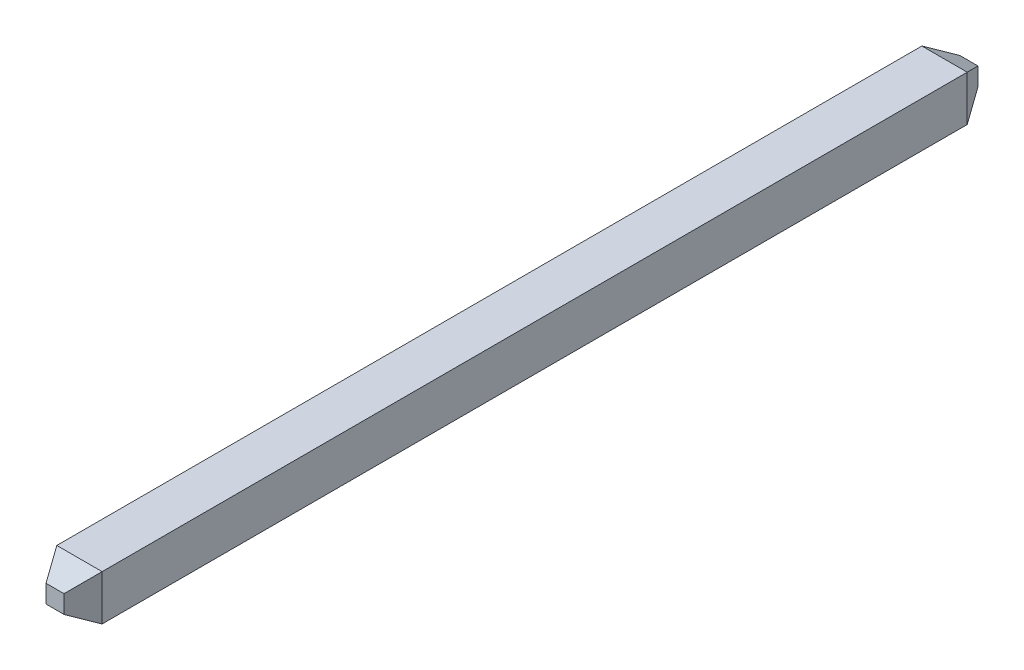
ISO-10303-21;
HEADER;
FILE_DESCRIPTION(('STEP AP214'),'2;1');
FILE_NAME('part.step','',(''),(''),'','','');
FILE_SCHEMA(('AUTOMOTIVE_DESIGN { 1 0 10303 214 1 1 1 1 }'));
ENDSEC;
DATA;
#1=APPLICATION_CONTEXT('core data for automotive mechanical design processes');
#2=APPLICATION_PROTOCOL_DEFINITION('international standard','automotive_design',2000,#1);
#3=PRODUCT_CONTEXT('',#1,'mechanical');
#4=PRODUCT('Part','Part','',(#3));
#5=PRODUCT_RELATED_PRODUCT_CATEGORY('part','',(#4));
#6=PRODUCT_DEFINITION_FORMATION('','',#4);
#7=PRODUCT_DEFINITION_CONTEXT('part definition',#1,'design');
#8=PRODUCT_DEFINITION('design','',#6,#7);
#9=PRODUCT_DEFINITION_SHAPE('','',#8);
#10=(LENGTH_UNIT() NAMED_UNIT(*) SI_UNIT(.MILLI.,.METRE.));
#11=(NAMED_UNIT(*) PLANE_ANGLE_UNIT() SI_UNIT($,.RADIAN.));
#12=(NAMED_UNIT(*) SI_UNIT($,.STERADIAN.) SOLID_ANGLE_UNIT());
#13=UNCERTAINTY_MEASURE_WITH_UNIT(LENGTH_MEASURE(1.E-05),#10,'distance_accuracy_value','');
#14=(GEOMETRIC_REPRESENTATION_CONTEXT(3) GLOBAL_UNCERTAINTY_ASSIGNED_CONTEXT((#13)) GLOBAL_UNIT_ASSIGNED_CONTEXT((#10,
#11,#12)) REPRESENTATION_CONTEXT('',''));
#15=CARTESIAN_POINT('',(0.,0.,0.));
#16=DIRECTION('',(0.,0.,1.));
#17=DIRECTION('',(1.,0.,0.));
#18=AXIS2_PLACEMENT_3D('',#15,#16,#17);
#19=CARTESIAN_POINT('',(2.66011510041924,-1.595,-3.20872569516347));
#20=DIRECTION('',(0.872569516347454,0.,-0.488489958076081));
#21=DIRECTION('',(-0.488489958076081,0.,-0.872569516347454));
#22=AXIS2_PLACEMENT_3D('',#19,#20,#21);
#23=PLANE('',#22);
#24=DIRECTION('',(0.,1.,0.));
#25=VECTOR('',#24,1.);
#26=CARTESIAN_POINT('',(2.85534185664468,-1.595,-2.86000017186176));
#27=LINE('',#26,#25);
#28=CARTESIAN_POINT('',(2.85534185663262,-1.58500002468493,-2.85999984563027));
#29=VERTEX_POINT('',#28);
#30=CARTESIAN_POINT('',(2.85534201729186,-0.954999839641339,-2.8599998849043));
#31=VERTEX_POINT('',#30);
#32=EDGE_CURVE('E145',#29,#31,#27,.T.);
#33=ORIENTED_EDGE('',*,*,#32,.F.);
#34=DIRECTION('',(0.439072617568647,-0.438284036988111,0.784297353956279));
#35=VECTOR('',#34,1.);
#36=CARTESIAN_POINT('',(2.665,-1.395,-3.2));
#37=LINE('',#36,#35);
#38=CARTESIAN_POINT('',(2.665,-1.395,-3.2));
#39=VERTEX_POINT('',#38);
#40=EDGE_CURVE('E142',#39,#29,#37,.T.);
#41=ORIENTED_EDGE('',*,*,#40,.F.);
#42=DIRECTION('',(0.,1.,0.));
#43=VECTOR('',#42,1.);
#44=CARTESIAN_POINT('',(2.665,-1.405,-3.2));
#45=LINE('',#44,#43);
#46=CARTESIAN_POINT('',(2.665,-1.145,-3.2));
#47=VERTEX_POINT('',#46);
#48=EDGE_CURVE('E94',#47,#39,#45,.F.);
#49=ORIENTED_EDGE('',*,*,#48,.F.);
#50=DIRECTION('',(-0.439072617568647,-0.438284036988111,-0.784297353956279));
#51=VECTOR('',#50,1.);
#52=CARTESIAN_POINT('',(2.85534185664468,-0.955000000000001,-2.86000017186176));
#53=LINE('',#52,#51);
#54=EDGE_CURVE('E134',#31,#47,#53,.T.);
#55=ORIENTED_EDGE('',*,*,#54,.F.);
#56=EDGE_LOOP('',(#33,#41,#49,#55));
#57=FACE_BOUND('',#56,.T.);
#58=ADVANCED_FACE('F16',(#57),#23,.T.);
#59=CARTESIAN_POINT('',(2.66036702814295,-1.595,9.50441734607014));
#60=DIRECTION('',(0.873317045523297,0.,0.487152273933376));
#61=DIRECTION('',(0.487152273933376,0.,-0.873317045523297));
#62=AXIS2_PLACEMENT_3D('',#59,#60,#61);
#63=PLANE('',#62);
#64=DIRECTION('',(-0.437799852400903,0.438586917260844,0.784839349959835));
#65=VECTOR('',#64,1.);
#66=CARTESIAN_POINT('',(2.85489789955164,-1.58500031317147,9.15568378706485));
#67=LINE('',#66,#65);
#68=CARTESIAN_POINT('',(2.85489765454992,-1.58500010892315,9.15568368845103));
#69=VERTEX_POINT('',#68);
#70=CARTESIAN_POINT('',(2.66523855088228,-1.395,9.49568417561491));
#71=VERTEX_POINT('',#70);
#72=EDGE_CURVE('E151',#69,#71,#67,.T.);
#73=ORIENTED_EDGE('',*,*,#72,.F.);
#74=DIRECTION('',(0.,1.,0.));
#75=VECTOR('',#74,1.);
#76=CARTESIAN_POINT('',(2.85489853900642,-1.595,9.155683722437));
#77=LINE('',#76,#75);
#78=CARTESIAN_POINT('',(2.8548976528046,-0.954999822967402,9.15568371270386));
#79=VERTEX_POINT('',#78);
#80=EDGE_CURVE('E105',#79,#69,#77,.F.);
#81=ORIENTED_EDGE('',*,*,#80,.F.);
#82=DIRECTION('',(0.437799852400902,0.438586917260844,-0.784839349959836));
#83=VECTOR('',#82,1.);
#84=CARTESIAN_POINT('',(2.66523855088228,-1.145,9.49568417561491));
#85=LINE('',#84,#83);
#86=CARTESIAN_POINT('',(2.66523855088228,-1.145,9.49568417561491));
#87=VERTEX_POINT('',#86);
#88=EDGE_CURVE('E100',#87,#79,#85,.T.);
#89=ORIENTED_EDGE('',*,*,#88,.F.);
#90=DIRECTION('',(0.,1.,0.));
#91=VECTOR('',#90,1.);
#92=CARTESIAN_POINT('',(2.66523855088228,-1.135,9.49568417561491));
#93=LINE('',#92,#91);
#94=EDGE_CURVE('E19',#71,#87,#93,.T.);
#95=ORIENTED_EDGE('',*,*,#94,.F.);
#96=EDGE_LOOP('',(#73,#81,#89,#95));
#97=FACE_BOUND('',#96,.T.);
#98=ADVANCED_FACE('F102',(#97),#63,.T.);
#99=CARTESIAN_POINT('',(2.40523855088228,-1.135,9.49568417561491));
#100=DIRECTION('',(0.,0.,1.));
#101=DIRECTION('',(1.,0.,0.));
#102=AXIS2_PLACEMENT_3D('',#99,#100,#101);
#103=PLANE('',#102);
#104=DIRECTION('',(1.,0.,0.));
#105=VECTOR('',#104,1.);
#106=CARTESIAN_POINT('',(2.2148966942376,-1.145,9.49568417561491));
#107=LINE('',#106,#105);
#108=CARTESIAN_POINT('',(2.41523855088228,-1.145,9.49568417561491));
#109=VERTEX_POINT('',#108);
#110=EDGE_CURVE('E110',#109,#87,#107,.T.);
#111=ORIENTED_EDGE('',*,*,#110,.F.);
#112=DIRECTION('',(0.,1.,0.));
#113=VECTOR('',#112,1.);
#114=CARTESIAN_POINT('',(2.41523855088228,-1.595,9.49568417561491));
#115=LINE('',#114,#113);
#116=CARTESIAN_POINT('',(2.41523855088228,-1.395,9.49568417561491));
#117=VERTEX_POINT('',#116);
#118=EDGE_CURVE('E160',#117,#109,#115,.T.);
#119=ORIENTED_EDGE('',*,*,#118,.F.);
#120=DIRECTION('',(1.,0.,0.));
#121=VECTOR('',#120,1.);
#122=CARTESIAN_POINT('',(2.2148966942376,-1.395,9.49568417561491));
#123=LINE('',#122,#121);
#124=EDGE_CURVE('E115',#71,#117,#123,.F.);
#125=ORIENTED_EDGE('',*,*,#124,.F.);
#126=ORIENTED_EDGE('',*,*,#94,.T.);
#127=EDGE_LOOP('',(#111,#119,#125,#126));
#128=FACE_BOUND('',#127,.T.);
#129=ADVANCED_FACE('F112',(#128),#103,.T.);
#130=CARTESIAN_POINT('',(2.2148966942376,-1.14987821545568,9.50441360938624));
#131=DIRECTION('',(0.,0.872943377132664,0.487821545567864));
#132=DIRECTION('',(0.,-0.487821545567864,0.872943377132664));
#133=AXIS2_PLACEMENT_3D('',#130,#131,#132);
#134=PLANE('',#133);
#135=DIRECTION('',(-0.439072459537933,0.438284700441648,-0.784297071672517));
#136=VECTOR('',#135,1.);
#137=CARTESIAN_POINT('',(2.41523855088228,-1.145,9.49568417561491));
#138=LINE('',#137,#136);
#139=CARTESIAN_POINT('',(2.2248975037028,-0.954999917527427,9.15568447138296));
#140=VERTEX_POINT('',#139);
#141=EDGE_CURVE('E120',#109,#140,#138,.T.);
#142=ORIENTED_EDGE('',*,*,#141,.F.);
#143=ORIENTED_EDGE('',*,*,#110,.T.);
#144=ORIENTED_EDGE('',*,*,#88,.T.);
#145=DIRECTION('',(1.,0.,0.));
#146=VECTOR('',#145,1.);
#147=CARTESIAN_POINT('',(2.54006658937282,-0.955,9.15568497320463));
#148=LINE('',#147,#146);
#149=EDGE_CURVE('E162',#140,#79,#148,.T.);
#150=ORIENTED_EDGE('',*,*,#149,.F.);
#151=EDGE_LOOP('',(#142,#143,#144,#150));
#152=FACE_BOUND('',#151,.T.);
#153=ADVANCED_FACE('F118',(#152),#134,.T.);
#154=CARTESIAN_POINT('',(2.405,-1.405,-3.2));
#155=DIRECTION('',(0.,0.,-1.));
#156=DIRECTION('',(-1.,0.,0.));
#157=AXIS2_PLACEMENT_3D('',#154,#155,#156);
#158=PLANE('',#157);
#159=ORIENTED_EDGE('',*,*,#48,.T.);
#160=DIRECTION('',(1.,0.,0.));
#161=VECTOR('',#160,1.);
#162=CARTESIAN_POINT('',(2.21534185664468,-1.395,-3.2));
#163=LINE('',#162,#161);
#164=CARTESIAN_POINT('',(2.415,-1.395,-3.2));
#165=VERTEX_POINT('',#164);
#166=EDGE_CURVE('E138',#165,#39,#163,.T.);
#167=ORIENTED_EDGE('',*,*,#166,.F.);
#168=DIRECTION('',(0.,1.,0.));
#169=VECTOR('',#168,1.);
#170=CARTESIAN_POINT('',(2.415,-1.595,-3.2));
#171=LINE('',#170,#169);
#172=CARTESIAN_POINT('',(2.415,-1.145,-3.2));
#173=VERTEX_POINT('',#172);
#174=EDGE_CURVE('E174',#173,#165,#171,.F.);
#175=ORIENTED_EDGE('',*,*,#174,.F.);
#176=DIRECTION('',(1.,0.,0.));
#177=VECTOR('',#176,1.);
#178=CARTESIAN_POINT('',(2.21534185664468,-1.145,-3.2));
#179=LINE('',#178,#177);
#180=EDGE_CURVE('E128',#47,#173,#179,.F.);
#181=ORIENTED_EDGE('',*,*,#180,.F.);
#182=EDGE_LOOP('',(#159,#167,#175,#181));
#183=FACE_BOUND('',#182,.T.);
#184=ADVANCED_FACE('F226',(#183),#158,.T.);
#185=CARTESIAN_POINT('',(2.21534185664468,-0.950121784544321,-2.85127073809043));
#186=DIRECTION('',(0.,0.872943377132663,-0.487821545567865));
#187=DIRECTION('',(0.,0.487821545567865,0.872943377132663));
#188=AXIS2_PLACEMENT_3D('',#185,#186,#187);
#189=PLANE('',#188);
#190=DIRECTION('',(1.,0.,0.));
#191=VECTOR('',#190,1.);
#192=CARTESIAN_POINT('',(2.54006658937282,-0.955,-2.86000017186176));
#193=LINE('',#192,#191);
#194=CARTESIAN_POINT('',(2.22534144768619,-0.954999293190895,-2.8599984305592));
#195=VERTEX_POINT('',#194);
#196=EDGE_CURVE('E170',#31,#195,#193,.F.);
#197=ORIENTED_EDGE('',*,*,#196,.F.);
#198=ORIENTED_EDGE('',*,*,#54,.T.);
#199=ORIENTED_EDGE('',*,*,#180,.T.);
#200=DIRECTION('',(0.437798396819591,-0.438586429089664,-0.784840434713052));
#201=VECTOR('',#200,1.);
#202=CARTESIAN_POINT('',(2.22534066407532,-0.954999279369218,-2.85999803394471));
#203=LINE('',#202,#201);
#204=EDGE_CURVE('E181',#195,#173,#203,.T.);
#205=ORIENTED_EDGE('',*,*,#204,.F.);
#206=EDGE_LOOP('',(#197,#198,#199,#205));
#207=FACE_BOUND('',#206,.T.);
#208=ADVANCED_FACE('F224',(#207),#189,.T.);
#209=CARTESIAN_POINT('',(2.21534185664468,-1.39012178454432,-3.20872943377133));
#210=DIRECTION('',(0.,-0.872943377132663,-0.487821545567865));
#211=DIRECTION('',(0.,0.487821545567865,-0.872943377132663));
#212=AXIS2_PLACEMENT_3D('',#209,#210,#211);
#213=PLANE('',#212);
#214=ORIENTED_EDGE('',*,*,#166,.T.);
#215=ORIENTED_EDGE('',*,*,#40,.T.);
#216=DIRECTION('',(1.,0.,0.));
#217=VECTOR('',#216,1.);
#218=CARTESIAN_POINT('',(2.21494834685547,-1.585,-2.85999756200982));
#219=LINE('',#218,#217);
#220=CARTESIAN_POINT('',(2.22534198218488,-1.58500027023654,-2.85999898491791));
#221=VERTEX_POINT('',#220);
#222=EDGE_CURVE('E39',#221,#29,#219,.T.);
#223=ORIENTED_EDGE('',*,*,#222,.F.);
#224=DIRECTION('',(-0.437798396819592,-0.438586429089661,0.784840434713054));
#225=VECTOR('',#224,1.);
#226=CARTESIAN_POINT('',(2.415,-1.395,-3.2));
#227=LINE('',#226,#225);
#228=EDGE_CURVE('E178',#165,#221,#227,.T.);
#229=ORIENTED_EDGE('',*,*,#228,.F.);
#230=EDGE_LOOP('',(#214,#215,#223,#229));
#231=FACE_BOUND('',#230,.T.);
#232=ADVANCED_FACE('F227',(#231),#213,.T.);
#233=CARTESIAN_POINT('',(2.85534630826875,-1.595,-2.98065701705514));
#234=DIRECTION('',(0.999999999319383,0.,3.68949151671631E-05));
#235=DIRECTION('',(3.68949151671631E-05,0.,-0.999999999319383));
#236=AXIS2_PLACEMENT_3D('',#233,#234,#235);
#237=PLANE('',#236);
#238=DIRECTION('',(3.69481335097372E-05,0.,-0.999999999317418));
#239=VECTOR('',#238,1.);
#240=CARTESIAN_POINT('',(2.85489789955164,-0.955,9.1556837224134));
#241=LINE('',#240,#239);
#242=EDGE_CURVE('E166',#79,#31,#241,.T.);
#243=ORIENTED_EDGE('',*,*,#242,.F.);
#244=ORIENTED_EDGE('',*,*,#80,.T.);
#245=DIRECTION('',(-3.69481335097372E-05,0.,0.999999999317418));
#246=VECTOR('',#245,1.);
#247=CARTESIAN_POINT('',(2.85534185664468,-1.585,-2.86000017186176));
#248=LINE('',#247,#246);
#249=EDGE_CURVE('E187',#29,#69,#248,.T.);
#250=ORIENTED_EDGE('',*,*,#249,.F.);
#251=ORIENTED_EDGE('',*,*,#32,.T.);
#252=EDGE_LOOP('',(#243,#244,#250,#251));
#253=FACE_BOUND('',#252,.T.);
#254=ADVANCED_FACE('F229',(#253),#237,.T.);
#255=CARTESIAN_POINT('',(2.2148966942376,-1.58987821545568,9.14695491370534));
#256=DIRECTION('',(0.,-0.872943377132664,0.487821545567864));
#257=DIRECTION('',(0.,-0.487821545567864,-0.872943377132664));
#258=AXIS2_PLACEMENT_3D('',#255,#256,#257);
#259=PLANE('',#258);
#260=ORIENTED_EDGE('',*,*,#124,.T.);
#261=DIRECTION('',(0.439072459537933,0.438284700441648,0.784297071672517));
#262=VECTOR('',#261,1.);
#263=CARTESIAN_POINT('',(2.22489724886554,-1.5849998023649,9.15568533818575));
#264=LINE('',#263,#262);
#265=CARTESIAN_POINT('',(2.22489781760237,-1.58499988392429,9.15568487573228));
#266=VERTEX_POINT('',#265);
#267=EDGE_CURVE('E156',#266,#117,#264,.T.);
#268=ORIENTED_EDGE('',*,*,#267,.F.);
#269=DIRECTION('',(1.,0.,0.));
#270=VECTOR('',#269,1.);
#271=CARTESIAN_POINT('',(2.21494834685547,-1.585,9.1556837224134));
#272=LINE('',#271,#270);
#273=EDGE_CURVE('E191',#69,#266,#272,.F.);
#274=ORIENTED_EDGE('',*,*,#273,.F.);
#275=ORIENTED_EDGE('',*,*,#72,.T.);
#276=EDGE_LOOP('',(#260,#268,#274,#275));
#277=FACE_BOUND('',#276,.T.);
#278=ADVANCED_FACE('F216',(#277),#259,.T.);
#279=CARTESIAN_POINT('',(2.42012345046304,-1.595,9.50440987077839));
#280=DIRECTION('',(-0.872569516347453,0.,0.488489958076081));
#281=DIRECTION('',(0.488489958076081,0.,0.872569516347453));
#282=AXIS2_PLACEMENT_3D('',#279,#280,#281);
#283=PLANE('',#282);
#284=ORIENTED_EDGE('',*,*,#267,.T.);
#285=ORIENTED_EDGE('',*,*,#118,.T.);
#286=ORIENTED_EDGE('',*,*,#141,.T.);
#287=DIRECTION('',(0.,1.,0.));
#288=VECTOR('',#287,1.);
#289=CARTESIAN_POINT('',(2.22489853896028,-1.595,9.15568497322818));
#290=LINE('',#289,#288);
#291=EDGE_CURVE('E194',#266,#140,#290,.T.);
#292=ORIENTED_EDGE('',*,*,#291,.F.);
#293=EDGE_LOOP('',(#284,#285,#286,#292));
#294=FACE_BOUND('',#293,.T.);
#295=ADVANCED_FACE('F219',(#294),#283,.T.);
#296=CARTESIAN_POINT('',(2.54006658937282,-0.955,9.32634470275115));
#297=DIRECTION('',(0.,1.,0.));
#298=DIRECTION('',(0.,0.,1.));
#299=AXIS2_PLACEMENT_3D('',#296,#297,#298);
#300=PLANE('',#299);
#301=ORIENTED_EDGE('',*,*,#196,.T.);
#302=DIRECTION('',(-3.68949151674615E-05,0.,0.999999999319383));
#303=VECTOR('',#302,1.);
#304=CARTESIAN_POINT('',(2.22489224235438,-0.955000197635096,9.32634821671993));
#305=LINE('',#304,#303);
#306=EDGE_CURVE('E198',#140,#195,#305,.F.);
#307=ORIENTED_EDGE('',*,*,#306,.F.);
#308=ORIENTED_EDGE('',*,*,#149,.T.);
#309=ORIENTED_EDGE('',*,*,#242,.T.);
#310=EDGE_LOOP('',(#301,#307,#308,#309));
#311=FACE_BOUND('',#310,.T.);
#312=ADVANCED_FACE('F221',(#311),#300,.T.);
#313=CARTESIAN_POINT('',(2.41987152273933,-1.595,-3.20873317045523));
#314=DIRECTION('',(-0.873317045523298,0.,-0.487152273933376));
#315=DIRECTION('',(-0.487152273933376,0.,0.873317045523298));
#316=AXIS2_PLACEMENT_3D('',#313,#314,#315);
#317=PLANE('',#316);
#318=DIRECTION('',(0.,1.,0.));
#319=VECTOR('',#318,1.);
#320=CARTESIAN_POINT('',(2.22534185654839,-1.595,-2.85999756199704));
#321=LINE('',#320,#319);
#322=EDGE_CURVE('E26',#195,#221,#321,.F.);
#323=ORIENTED_EDGE('',*,*,#322,.F.);
#324=ORIENTED_EDGE('',*,*,#204,.T.);
#325=ORIENTED_EDGE('',*,*,#174,.T.);
#326=ORIENTED_EDGE('',*,*,#228,.T.);
#327=EDGE_LOOP('',(#323,#324,#325,#326));
#328=FACE_BOUND('',#327,.T.);
#329=ADVANCED_FACE('F210',(#328),#317,.T.);
#330=CARTESIAN_POINT('',(2.21494834685547,-1.585,3.17284922525592));
#331=DIRECTION('',(0.,-1.,0.));
#332=DIRECTION('',(0.,0.,-1.));
#333=AXIS2_PLACEMENT_3D('',#330,#331,#332);
#334=PLANE('',#333);
#335=ORIENTED_EDGE('',*,*,#249,.T.);
#336=ORIENTED_EDGE('',*,*,#273,.T.);
#337=DIRECTION('',(-3.68949151674615E-05,0.,0.999999999319383));
#338=VECTOR('',#337,1.);
#339=CARTESIAN_POINT('',(2.22489224235438,-1.58500072063078,9.32634821671993));
#340=LINE('',#339,#338);
#341=EDGE_CURVE('E11',#221,#266,#340,.T.);
#342=ORIENTED_EDGE('',*,*,#341,.F.);
#343=ORIENTED_EDGE('',*,*,#222,.T.);
#344=EDGE_LOOP('',(#335,#336,#342,#343));
#345=FACE_BOUND('',#344,.T.);
#346=ADVANCED_FACE('F212',(#345),#334,.T.);
#347=CARTESIAN_POINT('',(2.22489224235438,-1.595,9.32634821671993));
#348=DIRECTION('',(-0.999999999319383,0.,-3.68949151674615E-05));
#349=DIRECTION('',(-3.68949151674615E-05,0.,0.999999999319383));
#350=AXIS2_PLACEMENT_3D('',#347,#348,#349);
#351=PLANE('',#350);
#352=ORIENTED_EDGE('',*,*,#322,.T.);
#353=ORIENTED_EDGE('',*,*,#341,.T.);
#354=ORIENTED_EDGE('',*,*,#291,.T.);
#355=ORIENTED_EDGE('',*,*,#306,.T.);
#356=EDGE_LOOP('',(#352,#353,#354,#355));
#357=FACE_BOUND('',#356,.T.);
#358=ADVANCED_FACE('F206',(#357),#351,.T.);
#359=CLOSED_SHELL('',(#58,#98,#129,#153,#184,#208,#232,#254,#278,#295,#312,#329,#346,#358));
#360=MANIFOLD_SOLID_BREP('B1',#359);
#361=ADVANCED_BREP_SHAPE_REPRESENTATION('',(#18,#360),#14);
#362=SHAPE_DEFINITION_REPRESENTATION(#9,#361);
ENDSEC;
END-ISO-10303-21;
